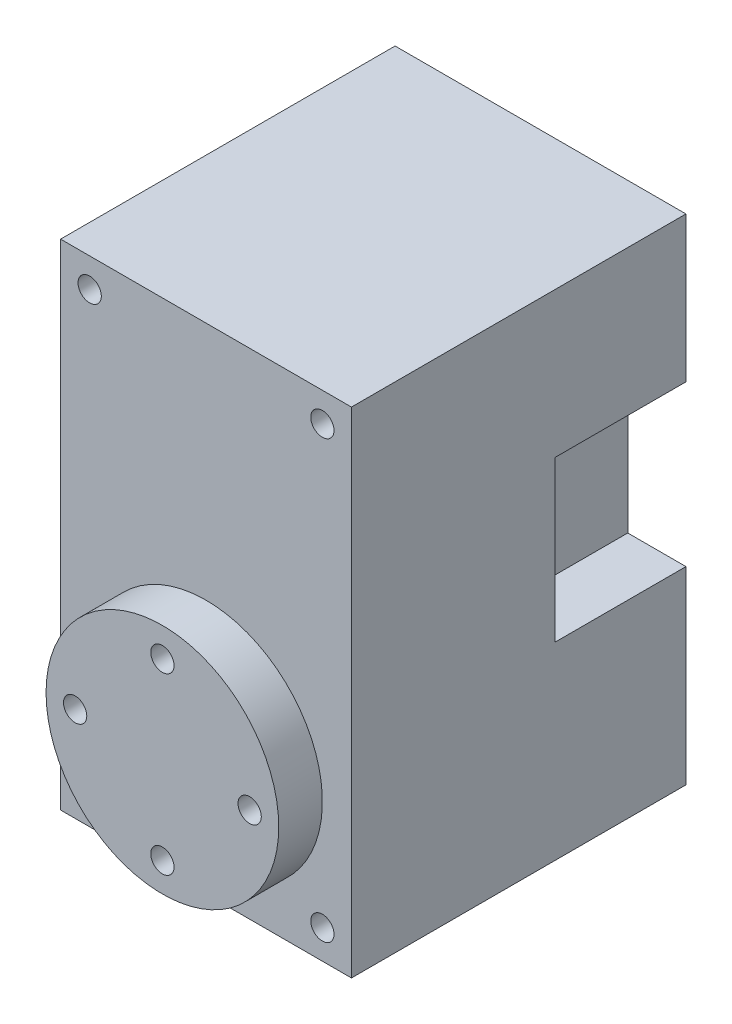
ISO-10303-21;
HEADER;
FILE_DESCRIPTION(('STEP AP214'),'2;1');
FILE_NAME('part.step','',(''),(''),'','','');
FILE_SCHEMA(('AUTOMOTIVE_DESIGN { 1 0 10303 214 1 1 1 1 }'));
ENDSEC;
DATA;
#1=APPLICATION_CONTEXT('core data for automotive mechanical design processes');
#2=APPLICATION_PROTOCOL_DEFINITION('international standard','automotive_design',2000,#1);
#3=PRODUCT_CONTEXT('',#1,'mechanical');
#4=PRODUCT('Part','Part','',(#3));
#5=PRODUCT_RELATED_PRODUCT_CATEGORY('part','',(#4));
#6=PRODUCT_DEFINITION_FORMATION('','',#4);
#7=PRODUCT_DEFINITION_CONTEXT('part definition',#1,'design');
#8=PRODUCT_DEFINITION('design','',#6,#7);
#9=PRODUCT_DEFINITION_SHAPE('','',#8);
#10=(LENGTH_UNIT() NAMED_UNIT(*) SI_UNIT(.MILLI.,.METRE.));
#11=(NAMED_UNIT(*) PLANE_ANGLE_UNIT() SI_UNIT($,.RADIAN.));
#12=(NAMED_UNIT(*) SI_UNIT($,.STERADIAN.) SOLID_ANGLE_UNIT());
#13=UNCERTAINTY_MEASURE_WITH_UNIT(LENGTH_MEASURE(1.E-05),#10,'distance_accuracy_value','');
#14=(GEOMETRIC_REPRESENTATION_CONTEXT(3) GLOBAL_UNCERTAINTY_ASSIGNED_CONTEXT((#13)) GLOBAL_UNIT_ASSIGNED_CONTEXT((#10,
#11,#12)) REPRESENTATION_CONTEXT('',''));
#15=CARTESIAN_POINT('',(0.,0.,0.));
#16=DIRECTION('',(0.,0.,1.));
#17=DIRECTION('',(1.,0.,0.));
#18=AXIS2_PLACEMENT_3D('',#15,#16,#17);
#19=CARTESIAN_POINT('',(0.,34.,0.));
#20=DIRECTION('',(1.,0.,0.));
#21=DIRECTION('',(0.,0.,-1.));
#22=AXIS2_PLACEMENT_3D('',#19,#20,#21);
#23=PLANE('',#22);
#24=DIRECTION('',(0.,1.,0.));
#25=VECTOR('',#24,1.);
#26=CARTESIAN_POINT('',(0.,13.,-14.));
#27=LINE('',#26,#25);
#28=CARTESIAN_POINT('',(0.,13.,-14.));
#29=VERTEX_POINT('',#28);
#30=CARTESIAN_POINT('',(0.,24.,-14.));
#31=VERTEX_POINT('',#30);
#32=EDGE_CURVE('E149',#29,#31,#27,.T.);
#33=ORIENTED_EDGE('',*,*,#32,.F.);
#34=DIRECTION('',(0.,0.,-1.));
#35=VECTOR('',#34,1.);
#36=CARTESIAN_POINT('',(0.,13.,-14.));
#37=LINE('',#36,#35);
#38=CARTESIAN_POINT('',(0.,13.,-23.));
#39=VERTEX_POINT('',#38);
#40=EDGE_CURVE('E168',#29,#39,#37,.T.);
#41=ORIENTED_EDGE('',*,*,#40,.T.);
#42=DIRECTION('',(0.,-1.,0.));
#43=VECTOR('',#42,1.);
#44=CARTESIAN_POINT('',(0.,34.,-23.));
#45=LINE('',#44,#43);
#46=CARTESIAN_POINT('',(0.,0.,-23.));
#47=VERTEX_POINT('',#46);
#48=EDGE_CURVE('E240',#39,#47,#45,.T.);
#49=ORIENTED_EDGE('',*,*,#48,.T.);
#50=DIRECTION('',(0.,0.,1.));
#51=VECTOR('',#50,1.);
#52=CARTESIAN_POINT('',(0.,0.,0.));
#53=LINE('',#52,#51);
#54=CARTESIAN_POINT('',(0.,0.,0.));
#55=VERTEX_POINT('',#54);
#56=EDGE_CURVE('E227',#47,#55,#53,.T.);
#57=ORIENTED_EDGE('',*,*,#56,.T.);
#58=DIRECTION('',(0.,-1.,0.));
#59=VECTOR('',#58,1.);
#60=CARTESIAN_POINT('',(0.,34.,0.));
#61=LINE('',#60,#59);
#62=CARTESIAN_POINT('',(0.,34.,0.));
#63=VERTEX_POINT('',#62);
#64=EDGE_CURVE('E39',#63,#55,#61,.T.);
#65=ORIENTED_EDGE('',*,*,#64,.F.);
#66=DIRECTION('',(0.,0.,1.));
#67=VECTOR('',#66,1.);
#68=CARTESIAN_POINT('',(0.,34.,0.));
#69=LINE('',#68,#67);
#70=CARTESIAN_POINT('',(0.,34.,-23.));
#71=VERTEX_POINT('',#70);
#72=EDGE_CURVE('E230',#71,#63,#69,.T.);
#73=ORIENTED_EDGE('',*,*,#72,.F.);
#74=CARTESIAN_POINT('',(0.,24.,-23.));
#75=VERTEX_POINT('',#74);
#76=EDGE_CURVE('E249',#71,#75,#45,.T.);
#77=ORIENTED_EDGE('',*,*,#76,.T.);
#78=DIRECTION('',(0.,0.,-1.));
#79=VECTOR('',#78,1.);
#80=CARTESIAN_POINT('',(0.,24.,-14.));
#81=LINE('',#80,#79);
#82=EDGE_CURVE('E54',#31,#75,#81,.T.);
#83=ORIENTED_EDGE('',*,*,#82,.F.);
#84=EDGE_LOOP('',(#33,#41,#49,#57,#65,#73,#77,#83));
#85=FACE_BOUND('',#84,.T.);
#86=ADVANCED_FACE('F32',(#85),#23,.F.);
#87=CARTESIAN_POINT('',(0.,34.,0.));
#88=DIRECTION('',(0.,0.,-1.));
#89=DIRECTION('',(-1.,0.,0.));
#90=AXIS2_PLACEMENT_3D('',#87,#88,#89);
#91=PLANE('',#90);
#92=CARTESIAN_POINT('',(10.,9.5,0.));
#93=DIRECTION('',(0.,0.,-1.));
#94=DIRECTION('',(-1.,0.,0.));
#95=AXIS2_PLACEMENT_3D('',#92,#93,#94);
#96=CIRCLE('',#95,8.);
#97=CARTESIAN_POINT('',(2.,9.5,0.));
#98=VERTEX_POINT('',#97);
#99=EDGE_CURVE('E11',#98,#98,#96,.F.);
#100=ORIENTED_EDGE('',*,*,#99,.F.);
#101=EDGE_LOOP('',(#100));
#102=FACE_BOUND('',#101,.T.);
#103=CARTESIAN_POINT('',(2.,2.00000000000001,0.));
#104=DIRECTION('',(0.,0.,1.));
#105=DIRECTION('',(1.,0.,0.));
#106=AXIS2_PLACEMENT_3D('',#103,#104,#105);
#107=CIRCLE('',#106,0.8);
#108=CARTESIAN_POINT('',(2.8,2.00000000000001,0.));
#109=VERTEX_POINT('',#108);
#110=EDGE_CURVE('E205',#109,#109,#107,.T.);
#111=ORIENTED_EDGE('',*,*,#110,.F.);
#112=EDGE_LOOP('',(#111));
#113=FACE_BOUND('',#112,.T.);
#114=CARTESIAN_POINT('',(18.,2.00000000000001,0.));
#115=DIRECTION('',(0.,0.,1.));
#116=DIRECTION('',(1.,0.,0.));
#117=AXIS2_PLACEMENT_3D('',#114,#115,#116);
#118=CIRCLE('',#117,0.799999999999999);
#119=CARTESIAN_POINT('',(18.8,2.00000000000001,0.));
#120=VERTEX_POINT('',#119);
#121=EDGE_CURVE('E216',#120,#120,#118,.T.);
#122=ORIENTED_EDGE('',*,*,#121,.F.);
#123=EDGE_LOOP('',(#122));
#124=FACE_BOUND('',#123,.T.);
#125=CARTESIAN_POINT('',(18.,32.,0.));
#126=DIRECTION('',(0.,0.,1.));
#127=DIRECTION('',(1.,0.,0.));
#128=AXIS2_PLACEMENT_3D('',#125,#126,#127);
#129=CIRCLE('',#128,0.8);
#130=CARTESIAN_POINT('',(18.8,32.,0.));
#131=VERTEX_POINT('',#130);
#132=EDGE_CURVE('E210',#131,#131,#129,.T.);
#133=ORIENTED_EDGE('',*,*,#132,.F.);
#134=EDGE_LOOP('',(#133));
#135=FACE_BOUND('',#134,.T.);
#136=CARTESIAN_POINT('',(2.,32.,0.));
#137=DIRECTION('',(0.,0.,1.));
#138=DIRECTION('',(1.,0.,0.));
#139=AXIS2_PLACEMENT_3D('',#136,#137,#138);
#140=CIRCLE('',#139,0.800000000000001);
#141=CARTESIAN_POINT('',(2.8,32.,0.));
#142=VERTEX_POINT('',#141);
#143=EDGE_CURVE('E209',#142,#142,#140,.T.);
#144=ORIENTED_EDGE('',*,*,#143,.F.);
#145=EDGE_LOOP('',(#144));
#146=FACE_BOUND('',#145,.T.);
#147=DIRECTION('',(1.,0.,0.));
#148=VECTOR('',#147,1.);
#149=CARTESIAN_POINT('',(0.,0.,0.));
#150=LINE('',#149,#148);
#151=CARTESIAN_POINT('',(20.,0.,0.));
#152=VERTEX_POINT('',#151);
#153=EDGE_CURVE('E243',#55,#152,#150,.T.);
#154=ORIENTED_EDGE('',*,*,#153,.T.);
#155=DIRECTION('',(0.,-1.,0.));
#156=VECTOR('',#155,1.);
#157=CARTESIAN_POINT('',(20.,34.,0.));
#158=LINE('',#157,#156);
#159=CARTESIAN_POINT('',(20.,34.,0.));
#160=VERTEX_POINT('',#159);
#161=EDGE_CURVE('E255',#160,#152,#158,.T.);
#162=ORIENTED_EDGE('',*,*,#161,.F.);
#163=DIRECTION('',(1.,0.,0.));
#164=VECTOR('',#163,1.);
#165=CARTESIAN_POINT('',(0.,34.,0.));
#166=LINE('',#165,#164);
#167=EDGE_CURVE('E233',#63,#160,#166,.T.);
#168=ORIENTED_EDGE('',*,*,#167,.F.);
#169=ORIENTED_EDGE('',*,*,#64,.T.);
#170=EDGE_LOOP('',(#154,#162,#168,#169));
#171=FACE_BOUND('',#170,.T.);
#172=ADVANCED_FACE('F260',(#102,#113,#124,#135,#146,#171),#91,.F.);
#173=CARTESIAN_POINT('',(20.,34.,0.));
#174=DIRECTION('',(-1.,0.,0.));
#175=DIRECTION('',(0.,0.,1.));
#176=AXIS2_PLACEMENT_3D('',#173,#174,#175);
#177=PLANE('',#176);
#178=DIRECTION('',(0.,-1.,0.));
#179=VECTOR('',#178,1.);
#180=CARTESIAN_POINT('',(20.,13.,-14.));
#181=LINE('',#180,#179);
#182=CARTESIAN_POINT('',(20.,24.,-14.));
#183=VERTEX_POINT('',#182);
#184=CARTESIAN_POINT('',(20.,13.,-14.));
#185=VERTEX_POINT('',#184);
#186=EDGE_CURVE('E128',#183,#185,#181,.T.);
#187=ORIENTED_EDGE('',*,*,#186,.F.);
#188=DIRECTION('',(0.,0.,-1.));
#189=VECTOR('',#188,1.);
#190=CARTESIAN_POINT('',(20.,24.,-14.));
#191=LINE('',#190,#189);
#192=CARTESIAN_POINT('',(20.,24.,-23.));
#193=VERTEX_POINT('',#192);
#194=EDGE_CURVE('E184',#183,#193,#191,.T.);
#195=ORIENTED_EDGE('',*,*,#194,.T.);
#196=DIRECTION('',(0.,-1.,0.));
#197=VECTOR('',#196,1.);
#198=CARTESIAN_POINT('',(20.,34.,-23.));
#199=LINE('',#198,#197);
#200=CARTESIAN_POINT('',(20.,34.,-23.));
#201=VERTEX_POINT('',#200);
#202=EDGE_CURVE('E252',#201,#193,#199,.T.);
#203=ORIENTED_EDGE('',*,*,#202,.F.);
#204=DIRECTION('',(0.,0.,-1.));
#205=VECTOR('',#204,1.);
#206=CARTESIAN_POINT('',(20.,34.,0.));
#207=LINE('',#206,#205);
#208=EDGE_CURVE('E236',#160,#201,#207,.T.);
#209=ORIENTED_EDGE('',*,*,#208,.F.);
#210=ORIENTED_EDGE('',*,*,#161,.T.);
#211=DIRECTION('',(0.,0.,-1.));
#212=VECTOR('',#211,1.);
#213=CARTESIAN_POINT('',(20.,0.,0.));
#214=LINE('',#213,#212);
#215=CARTESIAN_POINT('',(20.,0.,-23.));
#216=VERTEX_POINT('',#215);
#217=EDGE_CURVE('E245',#152,#216,#214,.T.);
#218=ORIENTED_EDGE('',*,*,#217,.T.);
#219=CARTESIAN_POINT('',(20.,13.,-23.));
#220=VERTEX_POINT('',#219);
#221=EDGE_CURVE('E142',#220,#216,#199,.T.);
#222=ORIENTED_EDGE('',*,*,#221,.F.);
#223=DIRECTION('',(0.,0.,-1.));
#224=VECTOR('',#223,1.);
#225=CARTESIAN_POINT('',(20.,13.,-14.));
#226=LINE('',#225,#224);
#227=EDGE_CURVE('E46',#185,#220,#226,.T.);
#228=ORIENTED_EDGE('',*,*,#227,.F.);
#229=EDGE_LOOP('',(#187,#195,#203,#209,#210,#218,#222,#228));
#230=FACE_BOUND('',#229,.T.);
#231=ADVANCED_FACE('F140',(#230),#177,.F.);
#232=CARTESIAN_POINT('',(0.,34.,-23.));
#233=DIRECTION('',(0.,0.,1.));
#234=DIRECTION('',(1.,0.,0.));
#235=AXIS2_PLACEMENT_3D('',#232,#233,#234);
#236=PLANE('',#235);
#237=CARTESIAN_POINT('',(2.,2.00000000000001,-23.));
#238=DIRECTION('',(0.,0.,1.));
#239=DIRECTION('',(1.,0.,0.));
#240=AXIS2_PLACEMENT_3D('',#237,#238,#239);
#241=CIRCLE('',#240,0.8);
#242=CARTESIAN_POINT('',(2.8,2.00000000000001,-23.));
#243=VERTEX_POINT('',#242);
#244=EDGE_CURVE('E219',#243,#243,#241,.T.);
#245=ORIENTED_EDGE('',*,*,#244,.T.);
#246=EDGE_LOOP('',(#245));
#247=FACE_BOUND('',#246,.T.);
#248=CARTESIAN_POINT('',(18.,2.00000000000001,-23.));
#249=DIRECTION('',(0.,0.,1.));
#250=DIRECTION('',(1.,0.,0.));
#251=AXIS2_PLACEMENT_3D('',#248,#249,#250);
#252=CIRCLE('',#251,0.799999999999999);
#253=CARTESIAN_POINT('',(18.8,2.00000000000001,-23.));
#254=VERTEX_POINT('',#253);
#255=EDGE_CURVE('E213',#254,#254,#252,.T.);
#256=ORIENTED_EDGE('',*,*,#255,.T.);
#257=EDGE_LOOP('',(#256));
#258=FACE_BOUND('',#257,.T.);
#259=CARTESIAN_POINT('',(18.,32.,-23.));
#260=DIRECTION('',(0.,0.,1.));
#261=DIRECTION('',(1.,0.,0.));
#262=AXIS2_PLACEMENT_3D('',#259,#260,#261);
#263=CIRCLE('',#262,0.8);
#264=CARTESIAN_POINT('',(18.8,32.,-23.));
#265=VERTEX_POINT('',#264);
#266=EDGE_CURVE('E206',#265,#265,#263,.T.);
#267=ORIENTED_EDGE('',*,*,#266,.T.);
#268=EDGE_LOOP('',(#267));
#269=FACE_BOUND('',#268,.T.);
#270=CARTESIAN_POINT('',(2.,32.,-23.));
#271=DIRECTION('',(0.,0.,1.));
#272=DIRECTION('',(1.,0.,0.));
#273=AXIS2_PLACEMENT_3D('',#270,#271,#272);
#274=CIRCLE('',#273,0.800000000000001);
#275=CARTESIAN_POINT('',(2.8,32.,-23.));
#276=VERTEX_POINT('',#275);
#277=EDGE_CURVE('E224',#276,#276,#274,.T.);
#278=ORIENTED_EDGE('',*,*,#277,.T.);
#279=EDGE_LOOP('',(#278));
#280=FACE_BOUND('',#279,.T.);
#281=ORIENTED_EDGE('',*,*,#202,.T.);
#282=DIRECTION('',(1.,0.,0.));
#283=VECTOR('',#282,1.);
#284=CARTESIAN_POINT('',(20.,24.,-23.));
#285=LINE('',#284,#283);
#286=CARTESIAN_POINT('',(16.,24.,-23.));
#287=VERTEX_POINT('',#286);
#288=EDGE_CURVE('E137',#287,#193,#285,.T.);
#289=ORIENTED_EDGE('',*,*,#288,.F.);
#290=DIRECTION('',(0.,1.,0.));
#291=VECTOR('',#290,1.);
#292=CARTESIAN_POINT('',(16.,13.,-23.));
#293=LINE('',#292,#291);
#294=CARTESIAN_POINT('',(16.,13.,-23.));
#295=VERTEX_POINT('',#294);
#296=EDGE_CURVE('E292',#295,#287,#293,.T.);
#297=ORIENTED_EDGE('',*,*,#296,.F.);
#298=DIRECTION('',(-1.,0.,0.));
#299=VECTOR('',#298,1.);
#300=CARTESIAN_POINT('',(20.,13.,-23.));
#301=LINE('',#300,#299);
#302=EDGE_CURVE('E171',#220,#295,#301,.T.);
#303=ORIENTED_EDGE('',*,*,#302,.F.);
#304=ORIENTED_EDGE('',*,*,#221,.T.);
#305=DIRECTION('',(-1.,0.,0.));
#306=VECTOR('',#305,1.);
#307=CARTESIAN_POINT('',(0.,0.,-23.));
#308=LINE('',#307,#306);
#309=EDGE_CURVE('E234',#216,#47,#308,.T.);
#310=ORIENTED_EDGE('',*,*,#309,.T.);
#311=ORIENTED_EDGE('',*,*,#48,.F.);
#312=DIRECTION('',(-1.,0.,0.));
#313=VECTOR('',#312,1.);
#314=CARTESIAN_POINT('',(0.,13.,-23.));
#315=LINE('',#314,#313);
#316=CARTESIAN_POINT('',(4.,13.,-23.));
#317=VERTEX_POINT('',#316);
#318=EDGE_CURVE('E153',#317,#39,#315,.T.);
#319=ORIENTED_EDGE('',*,*,#318,.F.);
#320=DIRECTION('',(0.,-1.,0.));
#321=VECTOR('',#320,1.);
#322=CARTESIAN_POINT('',(4.,13.,-23.));
#323=LINE('',#322,#321);
#324=CARTESIAN_POINT('',(4.,24.,-23.));
#325=VERTEX_POINT('',#324);
#326=EDGE_CURVE('E164',#325,#317,#323,.T.);
#327=ORIENTED_EDGE('',*,*,#326,.F.);
#328=DIRECTION('',(1.,0.,0.));
#329=VECTOR('',#328,1.);
#330=CARTESIAN_POINT('',(0.,24.,-23.));
#331=LINE('',#330,#329);
#332=EDGE_CURVE('E162',#75,#325,#331,.T.);
#333=ORIENTED_EDGE('',*,*,#332,.F.);
#334=ORIENTED_EDGE('',*,*,#76,.F.);
#335=DIRECTION('',(-1.,0.,0.));
#336=VECTOR('',#335,1.);
#337=CARTESIAN_POINT('',(0.,34.,-23.));
#338=LINE('',#337,#336);
#339=EDGE_CURVE('E238',#201,#71,#338,.T.);
#340=ORIENTED_EDGE('',*,*,#339,.F.);
#341=EDGE_LOOP('',(#281,#289,#297,#303,#304,#310,#311,#319,#327,#333,#334,#340));
#342=FACE_BOUND('',#341,.T.);
#343=ADVANCED_FACE('F278',(#247,#258,#269,#280,#342),#236,.F.);
#344=CARTESIAN_POINT('',(0.,34.,0.));
#345=DIRECTION('',(0.,-1.,0.));
#346=DIRECTION('',(0.,0.,-1.));
#347=AXIS2_PLACEMENT_3D('',#344,#345,#346);
#348=PLANE('',#347);
#349=ORIENTED_EDGE('',*,*,#72,.T.);
#350=ORIENTED_EDGE('',*,*,#167,.T.);
#351=ORIENTED_EDGE('',*,*,#208,.T.);
#352=ORIENTED_EDGE('',*,*,#339,.T.);
#353=EDGE_LOOP('',(#349,#350,#351,#352));
#354=FACE_BOUND('',#353,.T.);
#355=ADVANCED_FACE('F275',(#354),#348,.F.);
#356=CARTESIAN_POINT('',(0.,0.,0.));
#357=DIRECTION('',(0.,-1.,0.));
#358=DIRECTION('',(0.,0.,-1.));
#359=AXIS2_PLACEMENT_3D('',#356,#357,#358);
#360=PLANE('',#359);
#361=ORIENTED_EDGE('',*,*,#56,.F.);
#362=ORIENTED_EDGE('',*,*,#309,.F.);
#363=ORIENTED_EDGE('',*,*,#217,.F.);
#364=ORIENTED_EDGE('',*,*,#153,.F.);
#365=EDGE_LOOP('',(#361,#362,#363,#364));
#366=FACE_BOUND('',#365,.T.);
#367=ADVANCED_FACE('F269',(#366),#360,.T.);
#368=CARTESIAN_POINT('',(2.,32.,-23.));
#369=DIRECTION('',(0.,0.,1.));
#370=DIRECTION('',(1.,0.,0.));
#371=AXIS2_PLACEMENT_3D('',#368,#369,#370);
#372=CYLINDRICAL_SURFACE('',#371,0.800000000000001);
#373=ORIENTED_EDGE('',*,*,#277,.F.);
#374=EDGE_LOOP('',(#373));
#375=FACE_BOUND('',#374,.T.);
#376=ORIENTED_EDGE('',*,*,#143,.T.);
#377=EDGE_LOOP('',(#376));
#378=FACE_BOUND('',#377,.T.);
#379=ADVANCED_FACE('F375',(#375,#378),#372,.F.);
#380=CARTESIAN_POINT('',(18.,32.,-23.));
#381=DIRECTION('',(0.,0.,1.));
#382=DIRECTION('',(1.,0.,0.));
#383=AXIS2_PLACEMENT_3D('',#380,#381,#382);
#384=CYLINDRICAL_SURFACE('',#383,0.8);
#385=ORIENTED_EDGE('',*,*,#266,.F.);
#386=EDGE_LOOP('',(#385));
#387=FACE_BOUND('',#386,.T.);
#388=ORIENTED_EDGE('',*,*,#132,.T.);
#389=EDGE_LOOP('',(#388));
#390=FACE_BOUND('',#389,.T.);
#391=ADVANCED_FACE('F371',(#387,#390),#384,.F.);
#392=CARTESIAN_POINT('',(18.,2.00000000000001,-23.));
#393=DIRECTION('',(0.,0.,1.));
#394=DIRECTION('',(1.,0.,0.));
#395=AXIS2_PLACEMENT_3D('',#392,#393,#394);
#396=CYLINDRICAL_SURFACE('',#395,0.799999999999999);
#397=ORIENTED_EDGE('',*,*,#255,.F.);
#398=EDGE_LOOP('',(#397));
#399=FACE_BOUND('',#398,.T.);
#400=ORIENTED_EDGE('',*,*,#121,.T.);
#401=EDGE_LOOP('',(#400));
#402=FACE_BOUND('',#401,.T.);
#403=ADVANCED_FACE('F374',(#399,#402),#396,.F.);
#404=CARTESIAN_POINT('',(2.,2.00000000000001,-23.));
#405=DIRECTION('',(0.,0.,1.));
#406=DIRECTION('',(1.,0.,0.));
#407=AXIS2_PLACEMENT_3D('',#404,#405,#406);
#408=CYLINDRICAL_SURFACE('',#407,0.8);
#409=ORIENTED_EDGE('',*,*,#244,.F.);
#410=EDGE_LOOP('',(#409));
#411=FACE_BOUND('',#410,.T.);
#412=ORIENTED_EDGE('',*,*,#110,.T.);
#413=EDGE_LOOP('',(#412));
#414=FACE_BOUND('',#413,.T.);
#415=ADVANCED_FACE('F366',(#411,#414),#408,.F.);
#416=CARTESIAN_POINT('',(10.,9.5,3.));
#417=DIRECTION('',(0.,0.,1.));
#418=DIRECTION('',(1.,0.,0.));
#419=AXIS2_PLACEMENT_3D('',#416,#417,#418);
#420=PLANE('',#419);
#421=CARTESIAN_POINT('',(10.,3.5,3.));
#422=DIRECTION('',(0.,0.,1.));
#423=DIRECTION('',(1.,0.,0.));
#424=AXIS2_PLACEMENT_3D('',#421,#422,#423);
#425=CIRCLE('',#424,0.800000000000001);
#426=CARTESIAN_POINT('',(10.8,3.5,3.));
#427=VERTEX_POINT('',#426);
#428=EDGE_CURVE('E185',#427,#427,#425,.T.);
#429=ORIENTED_EDGE('',*,*,#428,.F.);
#430=EDGE_LOOP('',(#429));
#431=FACE_BOUND('',#430,.T.);
#432=CARTESIAN_POINT('',(10.,15.5,3.));
#433=DIRECTION('',(0.,0.,1.));
#434=DIRECTION('',(1.,0.,0.));
#435=AXIS2_PLACEMENT_3D('',#432,#433,#434);
#436=CIRCLE('',#435,0.8);
#437=CARTESIAN_POINT('',(10.8,15.5,3.));
#438=VERTEX_POINT('',#437);
#439=EDGE_CURVE('E197',#438,#438,#436,.T.);
#440=ORIENTED_EDGE('',*,*,#439,.F.);
#441=EDGE_LOOP('',(#440));
#442=FACE_BOUND('',#441,.T.);
#443=CARTESIAN_POINT('',(10.,9.5,3.));
#444=DIRECTION('',(0.,0.,1.));
#445=DIRECTION('',(1.,0.,0.));
#446=AXIS2_PLACEMENT_3D('',#443,#444,#445);
#447=CIRCLE('',#446,8.);
#448=CARTESIAN_POINT('',(18.,9.5,3.));
#449=VERTEX_POINT('',#448);
#450=EDGE_CURVE('E200',#449,#449,#447,.T.);
#451=ORIENTED_EDGE('',*,*,#450,.T.);
#452=EDGE_LOOP('',(#451));
#453=FACE_BOUND('',#452,.T.);
#454=CARTESIAN_POINT('',(4.,9.5,3.));
#455=DIRECTION('',(0.,0.,1.));
#456=DIRECTION('',(1.,0.,0.));
#457=AXIS2_PLACEMENT_3D('',#454,#455,#456);
#458=CIRCLE('',#457,0.800000000000001);
#459=CARTESIAN_POINT('',(4.8,9.5,3.));
#460=VERTEX_POINT('',#459);
#461=EDGE_CURVE('E191',#460,#460,#458,.T.);
#462=ORIENTED_EDGE('',*,*,#461,.F.);
#463=EDGE_LOOP('',(#462));
#464=FACE_BOUND('',#463,.T.);
#465=CARTESIAN_POINT('',(16.,9.5,3.));
#466=DIRECTION('',(0.,0.,1.));
#467=DIRECTION('',(1.,0.,0.));
#468=AXIS2_PLACEMENT_3D('',#465,#466,#467);
#469=CIRCLE('',#468,0.799999999999999);
#470=CARTESIAN_POINT('',(16.8,9.5,3.));
#471=VERTEX_POINT('',#470);
#472=EDGE_CURVE('E177',#471,#471,#469,.T.);
#473=ORIENTED_EDGE('',*,*,#472,.F.);
#474=EDGE_LOOP('',(#473));
#475=FACE_BOUND('',#474,.T.);
#476=ADVANCED_FACE('F363',(#431,#442,#453,#464,#475),#420,.T.);
#477=CARTESIAN_POINT('',(10.,9.5,3.));
#478=DIRECTION('',(0.,0.,-1.));
#479=DIRECTION('',(-1.,0.,0.));
#480=AXIS2_PLACEMENT_3D('',#477,#478,#479);
#481=CYLINDRICAL_SURFACE('',#480,8.);
#482=ORIENTED_EDGE('',*,*,#450,.F.);
#483=EDGE_LOOP('',(#482));
#484=FACE_BOUND('',#483,.T.);
#485=ORIENTED_EDGE('',*,*,#99,.T.);
#486=EDGE_LOOP('',(#485));
#487=FACE_BOUND('',#486,.T.);
#488=ADVANCED_FACE('F361',(#484,#487),#481,.T.);
#489=CARTESIAN_POINT('',(10.,15.5,3.));
#490=DIRECTION('',(0.,0.,-1.));
#491=DIRECTION('',(-1.,0.,0.));
#492=AXIS2_PLACEMENT_3D('',#489,#490,#491);
#493=CYLINDRICAL_SURFACE('',#492,0.8);
#494=ORIENTED_EDGE('',*,*,#439,.T.);
#495=EDGE_LOOP('',(#494));
#496=FACE_BOUND('',#495,.T.);
#497=CARTESIAN_POINT('',(10.,15.5,0.));
#498=DIRECTION('',(0.,0.,1.));
#499=DIRECTION('',(1.,0.,0.));
#500=AXIS2_PLACEMENT_3D('',#497,#498,#499);
#501=CIRCLE('',#500,0.8);
#502=CARTESIAN_POINT('',(10.8,15.5,0.));
#503=VERTEX_POINT('',#502);
#504=EDGE_CURVE('E194',#503,#503,#501,.T.);
#505=ORIENTED_EDGE('',*,*,#504,.F.);
#506=EDGE_LOOP('',(#505));
#507=FACE_BOUND('',#506,.T.);
#508=ADVANCED_FACE('F354',(#496,#507),#493,.F.);
#509=CARTESIAN_POINT('',(4.,9.5,3.));
#510=DIRECTION('',(0.,0.,-1.));
#511=DIRECTION('',(-1.,0.,0.));
#512=AXIS2_PLACEMENT_3D('',#509,#510,#511);
#513=CYLINDRICAL_SURFACE('',#512,0.800000000000001);
#514=ORIENTED_EDGE('',*,*,#461,.T.);
#515=EDGE_LOOP('',(#514));
#516=FACE_BOUND('',#515,.T.);
#517=CARTESIAN_POINT('',(4.,9.5,0.));
#518=DIRECTION('',(0.,0.,1.));
#519=DIRECTION('',(1.,0.,0.));
#520=AXIS2_PLACEMENT_3D('',#517,#518,#519);
#521=CIRCLE('',#520,0.800000000000001);
#522=CARTESIAN_POINT('',(4.8,9.5,0.));
#523=VERTEX_POINT('',#522);
#524=EDGE_CURVE('E188',#523,#523,#521,.T.);
#525=ORIENTED_EDGE('',*,*,#524,.F.);
#526=EDGE_LOOP('',(#525));
#527=FACE_BOUND('',#526,.T.);
#528=ADVANCED_FACE('F348',(#516,#527),#513,.F.);
#529=CARTESIAN_POINT('',(10.,3.5,3.));
#530=DIRECTION('',(0.,0.,-1.));
#531=DIRECTION('',(-1.,0.,0.));
#532=AXIS2_PLACEMENT_3D('',#529,#530,#531);
#533=CYLINDRICAL_SURFACE('',#532,0.800000000000001);
#534=ORIENTED_EDGE('',*,*,#428,.T.);
#535=EDGE_LOOP('',(#534));
#536=FACE_BOUND('',#535,.T.);
#537=CARTESIAN_POINT('',(10.,3.5,0.));
#538=DIRECTION('',(0.,0.,1.));
#539=DIRECTION('',(1.,0.,0.));
#540=AXIS2_PLACEMENT_3D('',#537,#538,#539);
#541=CIRCLE('',#540,0.800000000000001);
#542=CARTESIAN_POINT('',(10.8,3.5,0.));
#543=VERTEX_POINT('',#542);
#544=EDGE_CURVE('E180',#543,#543,#541,.T.);
#545=ORIENTED_EDGE('',*,*,#544,.F.);
#546=EDGE_LOOP('',(#545));
#547=FACE_BOUND('',#546,.T.);
#548=ADVANCED_FACE('F342',(#536,#547),#533,.F.);
#549=CARTESIAN_POINT('',(16.,9.5,3.));
#550=DIRECTION('',(0.,0.,-1.));
#551=DIRECTION('',(-1.,0.,0.));
#552=AXIS2_PLACEMENT_3D('',#549,#550,#551);
#553=CYLINDRICAL_SURFACE('',#552,0.799999999999999);
#554=ORIENTED_EDGE('',*,*,#472,.T.);
#555=EDGE_LOOP('',(#554));
#556=FACE_BOUND('',#555,.T.);
#557=CARTESIAN_POINT('',(16.,9.5,0.));
#558=DIRECTION('',(0.,0.,1.));
#559=DIRECTION('',(1.,0.,0.));
#560=AXIS2_PLACEMENT_3D('',#557,#558,#559);
#561=CIRCLE('',#560,0.799999999999999);
#562=CARTESIAN_POINT('',(16.8,9.5,0.));
#563=VERTEX_POINT('',#562);
#564=EDGE_CURVE('E181',#563,#563,#561,.T.);
#565=ORIENTED_EDGE('',*,*,#564,.F.);
#566=EDGE_LOOP('',(#565));
#567=FACE_BOUND('',#566,.T.);
#568=ADVANCED_FACE('F335',(#556,#567),#553,.F.);
#569=ORIENTED_EDGE('',*,*,#544,.T.);
#570=EDGE_LOOP('',(#569));
#571=FACE_BOUND('',#570,.T.);
#572=ADVANCED_FACE('F329',(#571),#91,.F.);
#573=ORIENTED_EDGE('',*,*,#524,.T.);
#574=EDGE_LOOP('',(#573));
#575=FACE_BOUND('',#574,.T.);
#576=ADVANCED_FACE('F324',(#575),#91,.F.);
#577=ORIENTED_EDGE('',*,*,#504,.T.);
#578=EDGE_LOOP('',(#577));
#579=FACE_BOUND('',#578,.T.);
#580=ADVANCED_FACE('F315',(#579),#91,.F.);
#581=ORIENTED_EDGE('',*,*,#564,.T.);
#582=EDGE_LOOP('',(#581));
#583=FACE_BOUND('',#582,.T.);
#584=ADVANCED_FACE('F316',(#583),#91,.F.);
#585=CARTESIAN_POINT('',(0.,13.,-14.));
#586=DIRECTION('',(0.,-1.,0.));
#587=DIRECTION('',(0.,0.,-1.));
#588=AXIS2_PLACEMENT_3D('',#585,#586,#587);
#589=PLANE('',#588);
#590=ORIENTED_EDGE('',*,*,#318,.T.);
#591=ORIENTED_EDGE('',*,*,#40,.F.);
#592=DIRECTION('',(-1.,0.,0.));
#593=VECTOR('',#592,1.);
#594=CARTESIAN_POINT('',(0.,13.,-14.));
#595=LINE('',#594,#593);
#596=CARTESIAN_POINT('',(4.,13.,-14.));
#597=VERTEX_POINT('',#596);
#598=EDGE_CURVE('E159',#597,#29,#595,.T.);
#599=ORIENTED_EDGE('',*,*,#598,.F.);
#600=DIRECTION('',(0.,0.,-1.));
#601=VECTOR('',#600,1.);
#602=CARTESIAN_POINT('',(4.,13.,-14.));
#603=LINE('',#602,#601);
#604=EDGE_CURVE('E172',#597,#317,#603,.T.);
#605=ORIENTED_EDGE('',*,*,#604,.T.);
#606=EDGE_LOOP('',(#590,#591,#599,#605));
#607=FACE_BOUND('',#606,.T.);
#608=ADVANCED_FACE('F327',(#607),#589,.F.);
#609=CARTESIAN_POINT('',(4.,13.,-14.));
#610=DIRECTION('',(1.,0.,0.));
#611=DIRECTION('',(0.,0.,-1.));
#612=AXIS2_PLACEMENT_3D('',#609,#610,#611);
#613=PLANE('',#612);
#614=ORIENTED_EDGE('',*,*,#326,.T.);
#615=ORIENTED_EDGE('',*,*,#604,.F.);
#616=DIRECTION('',(0.,-1.,0.));
#617=VECTOR('',#616,1.);
#618=CARTESIAN_POINT('',(4.,13.,-14.));
#619=LINE('',#618,#617);
#620=CARTESIAN_POINT('',(4.,24.,-14.));
#621=VERTEX_POINT('',#620);
#622=EDGE_CURVE('E156',#621,#597,#619,.T.);
#623=ORIENTED_EDGE('',*,*,#622,.F.);
#624=DIRECTION('',(0.,0.,-1.));
#625=VECTOR('',#624,1.);
#626=CARTESIAN_POINT('',(4.,24.,-14.));
#627=LINE('',#626,#625);
#628=EDGE_CURVE('E174',#621,#325,#627,.T.);
#629=ORIENTED_EDGE('',*,*,#628,.T.);
#630=EDGE_LOOP('',(#614,#615,#623,#629));
#631=FACE_BOUND('',#630,.T.);
#632=ADVANCED_FACE('F284',(#631),#613,.F.);
#633=CARTESIAN_POINT('',(0.,24.,-14.));
#634=DIRECTION('',(0.,1.,0.));
#635=DIRECTION('',(0.,0.,1.));
#636=AXIS2_PLACEMENT_3D('',#633,#634,#635);
#637=PLANE('',#636);
#638=ORIENTED_EDGE('',*,*,#332,.T.);
#639=ORIENTED_EDGE('',*,*,#628,.F.);
#640=DIRECTION('',(1.,0.,0.));
#641=VECTOR('',#640,1.);
#642=CARTESIAN_POINT('',(0.,24.,-14.));
#643=LINE('',#642,#641);
#644=EDGE_CURVE('E152',#31,#621,#643,.T.);
#645=ORIENTED_EDGE('',*,*,#644,.F.);
#646=ORIENTED_EDGE('',*,*,#82,.T.);
#647=EDGE_LOOP('',(#638,#639,#645,#646));
#648=FACE_BOUND('',#647,.T.);
#649=ADVANCED_FACE('F281',(#648),#637,.F.);
#650=CARTESIAN_POINT('',(0.,0.,-14.));
#651=DIRECTION('',(0.,0.,-1.));
#652=DIRECTION('',(-1.,0.,0.));
#653=AXIS2_PLACEMENT_3D('',#650,#651,#652);
#654=PLANE('',#653);
#655=ORIENTED_EDGE('',*,*,#32,.T.);
#656=ORIENTED_EDGE('',*,*,#644,.T.);
#657=ORIENTED_EDGE('',*,*,#622,.T.);
#658=ORIENTED_EDGE('',*,*,#598,.T.);
#659=EDGE_LOOP('',(#655,#656,#657,#658));
#660=FACE_BOUND('',#659,.T.);
#661=ADVANCED_FACE('F287',(#660),#654,.T.);
#662=CARTESIAN_POINT('',(20.,24.,-14.));
#663=DIRECTION('',(0.,1.,0.));
#664=DIRECTION('',(0.,0.,1.));
#665=AXIS2_PLACEMENT_3D('',#662,#663,#664);
#666=PLANE('',#665);
#667=ORIENTED_EDGE('',*,*,#288,.T.);
#668=ORIENTED_EDGE('',*,*,#194,.F.);
#669=DIRECTION('',(1.,0.,0.));
#670=VECTOR('',#669,1.);
#671=CARTESIAN_POINT('',(20.,24.,-14.));
#672=LINE('',#671,#670);
#673=CARTESIAN_POINT('',(16.,24.,-14.));
#674=VERTEX_POINT('',#673);
#675=EDGE_CURVE('E134',#674,#183,#672,.T.);
#676=ORIENTED_EDGE('',*,*,#675,.F.);
#677=DIRECTION('',(0.,0.,-1.));
#678=VECTOR('',#677,1.);
#679=CARTESIAN_POINT('',(16.,24.,-14.));
#680=LINE('',#679,#678);
#681=EDGE_CURVE('E144',#674,#287,#680,.T.);
#682=ORIENTED_EDGE('',*,*,#681,.T.);
#683=EDGE_LOOP('',(#667,#668,#676,#682));
#684=FACE_BOUND('',#683,.T.);
#685=ADVANCED_FACE('F299',(#684),#666,.F.);
#686=CARTESIAN_POINT('',(16.,13.,-14.));
#687=DIRECTION('',(-1.,0.,0.));
#688=DIRECTION('',(0.,0.,1.));
#689=AXIS2_PLACEMENT_3D('',#686,#687,#688);
#690=PLANE('',#689);
#691=ORIENTED_EDGE('',*,*,#296,.T.);
#692=ORIENTED_EDGE('',*,*,#681,.F.);
#693=DIRECTION('',(0.,1.,0.));
#694=VECTOR('',#693,1.);
#695=CARTESIAN_POINT('',(16.,13.,-14.));
#696=LINE('',#695,#694);
#697=CARTESIAN_POINT('',(16.,13.,-14.));
#698=VERTEX_POINT('',#697);
#699=EDGE_CURVE('E127',#698,#674,#696,.T.);
#700=ORIENTED_EDGE('',*,*,#699,.F.);
#701=DIRECTION('',(0.,0.,-1.));
#702=VECTOR('',#701,1.);
#703=CARTESIAN_POINT('',(16.,13.,-14.));
#704=LINE('',#703,#702);
#705=EDGE_CURVE('E123',#698,#295,#704,.T.);
#706=ORIENTED_EDGE('',*,*,#705,.T.);
#707=EDGE_LOOP('',(#691,#692,#700,#706));
#708=FACE_BOUND('',#707,.T.);
#709=ADVANCED_FACE('F301',(#708),#690,.F.);
#710=CARTESIAN_POINT('',(20.,13.,-14.));
#711=DIRECTION('',(0.,-1.,0.));
#712=DIRECTION('',(0.,0.,-1.));
#713=AXIS2_PLACEMENT_3D('',#710,#711,#712);
#714=PLANE('',#713);
#715=ORIENTED_EDGE('',*,*,#302,.T.);
#716=ORIENTED_EDGE('',*,*,#705,.F.);
#717=DIRECTION('',(-1.,0.,0.));
#718=VECTOR('',#717,1.);
#719=CARTESIAN_POINT('',(20.,13.,-14.));
#720=LINE('',#719,#718);
#721=EDGE_CURVE('E120',#185,#698,#720,.T.);
#722=ORIENTED_EDGE('',*,*,#721,.F.);
#723=ORIENTED_EDGE('',*,*,#227,.T.);
#724=EDGE_LOOP('',(#715,#716,#722,#723));
#725=FACE_BOUND('',#724,.T.);
#726=ADVANCED_FACE('F122',(#725),#714,.F.);
#727=CARTESIAN_POINT('',(0.,0.,-14.));
#728=DIRECTION('',(0.,0.,1.));
#729=DIRECTION('',(1.,0.,0.));
#730=AXIS2_PLACEMENT_3D('',#727,#728,#729);
#731=PLANE('',#730);
#732=ORIENTED_EDGE('',*,*,#186,.T.);
#733=ORIENTED_EDGE('',*,*,#721,.T.);
#734=ORIENTED_EDGE('',*,*,#699,.T.);
#735=ORIENTED_EDGE('',*,*,#675,.T.);
#736=EDGE_LOOP('',(#732,#733,#734,#735));
#737=FACE_BOUND('',#736,.T.);
#738=ADVANCED_FACE('F132',(#737),#731,.F.);
#739=CLOSED_SHELL('',(#86,#172,#231,#343,#355,#367,#379,#391,#403,#415,#476,#488,#508,#528,#548,
#568,#572,#576,#580,#584,#608,#632,#649,#661,#685,#709,#726,#738));
#740=MANIFOLD_SOLID_BREP('B2',#739);
#741=ADVANCED_BREP_SHAPE_REPRESENTATION('',(#18,#740),#14);
#742=SHAPE_DEFINITION_REPRESENTATION(#9,#741);
ENDSEC;
END-ISO-10303-21;
